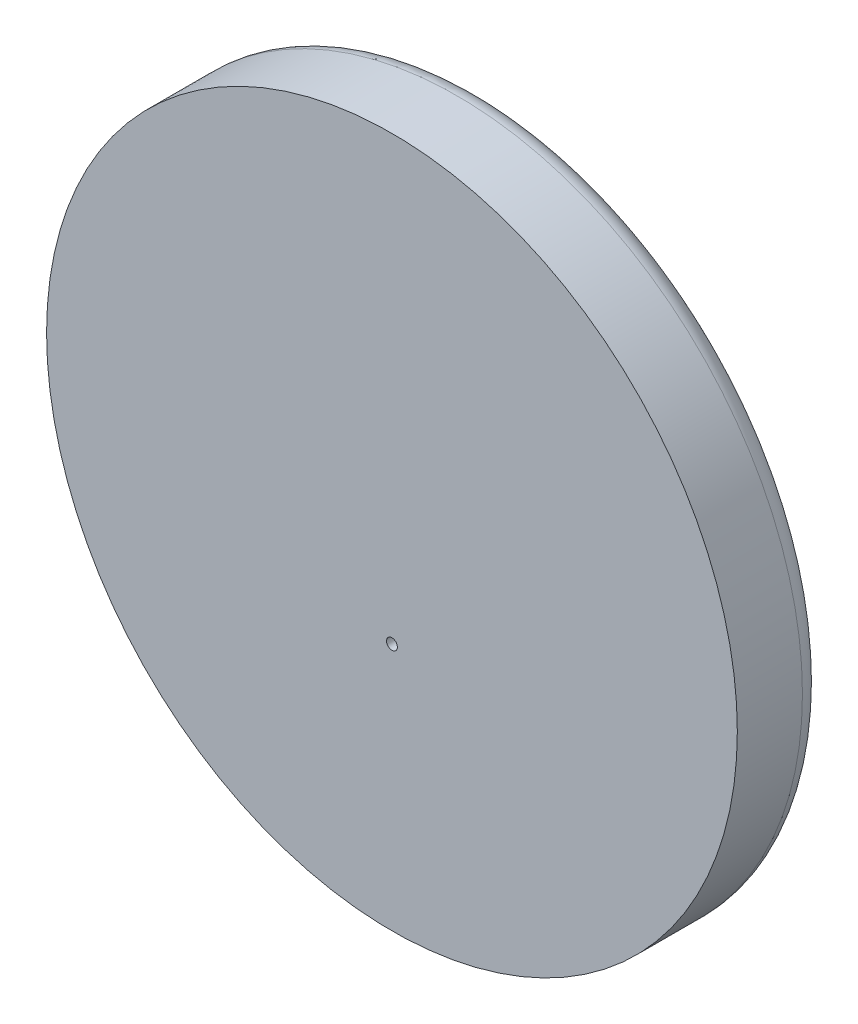
ISO-10303-21;
HEADER;
FILE_DESCRIPTION(('STEP AP214'),'2;1');
FILE_NAME('part.step','',(''),(''),'','','');
FILE_SCHEMA(('AUTOMOTIVE_DESIGN { 1 0 10303 214 1 1 1 1 }'));
ENDSEC;
DATA;
#1=APPLICATION_CONTEXT('core data for automotive mechanical design processes');
#2=APPLICATION_PROTOCOL_DEFINITION('international standard','automotive_design',2000,#1);
#3=PRODUCT_CONTEXT('',#1,'mechanical');
#4=PRODUCT('Part','Part','',(#3));
#5=PRODUCT_RELATED_PRODUCT_CATEGORY('part','',(#4));
#6=PRODUCT_DEFINITION_FORMATION('','',#4);
#7=PRODUCT_DEFINITION_CONTEXT('part definition',#1,'design');
#8=PRODUCT_DEFINITION('design','',#6,#7);
#9=PRODUCT_DEFINITION_SHAPE('','',#8);
#10=(LENGTH_UNIT() NAMED_UNIT(*) SI_UNIT(.MILLI.,.METRE.));
#11=(NAMED_UNIT(*) PLANE_ANGLE_UNIT() SI_UNIT($,.RADIAN.));
#12=(NAMED_UNIT(*) SI_UNIT($,.STERADIAN.) SOLID_ANGLE_UNIT());
#13=UNCERTAINTY_MEASURE_WITH_UNIT(LENGTH_MEASURE(1.E-05),#10,'distance_accuracy_value','');
#14=(GEOMETRIC_REPRESENTATION_CONTEXT(3) GLOBAL_UNCERTAINTY_ASSIGNED_CONTEXT((#13)) GLOBAL_UNIT_ASSIGNED_CONTEXT((#10,
#11,#12)) REPRESENTATION_CONTEXT('',''));
#15=CARTESIAN_POINT('',(0.,0.,0.));
#16=DIRECTION('',(0.,0.,1.));
#17=DIRECTION('',(1.,0.,0.));
#18=AXIS2_PLACEMENT_3D('',#15,#16,#17);
#19=CARTESIAN_POINT('',(0.,35.3882130465112,8.));
#20=DIRECTION('',(0.,0.,-1.));
#21=DIRECTION('',(-1.,0.,0.));
#22=AXIS2_PLACEMENT_3D('',#19,#20,#21);
#23=CYLINDRICAL_SURFACE('',#22,31.83);
#24=CARTESIAN_POINT('',(0.,35.3882130465112,2.));
#25=DIRECTION('',(0.,0.,1.));
#26=DIRECTION('',(1.,0.,0.));
#27=AXIS2_PLACEMENT_3D('',#24,#25,#26);
#28=CIRCLE('',#27,31.83);
#29=CARTESIAN_POINT('',(31.83,35.3882130465112,2.));
#30=VERTEX_POINT('',#29);
#31=EDGE_CURVE('E38',#30,#30,#28,.T.);
#32=ORIENTED_EDGE('',*,*,#31,.T.);
#33=EDGE_LOOP('',(#32));
#34=FACE_BOUND('',#33,.T.);
#35=CARTESIAN_POINT('',(0.,35.3882130465112,8.));
#36=DIRECTION('',(0.,0.,1.));
#37=DIRECTION('',(1.,0.,0.));
#38=AXIS2_PLACEMENT_3D('',#35,#36,#37);
#39=CIRCLE('',#38,31.83);
#40=CARTESIAN_POINT('',(31.83,35.3882130465112,8.));
#41=VERTEX_POINT('',#40);
#42=EDGE_CURVE('E42',#41,#41,#39,.T.);
#43=ORIENTED_EDGE('',*,*,#42,.F.);
#44=EDGE_LOOP('',(#43));
#45=FACE_BOUND('',#44,.T.);
#46=ADVANCED_FACE('F31',(#34,#45),#23,.T.);
#47=CARTESIAN_POINT('',(0.,35.3882130465112,8.));
#48=DIRECTION('',(0.,0.,1.));
#49=DIRECTION('',(1.,0.,0.));
#50=AXIS2_PLACEMENT_3D('',#47,#48,#49);
#51=PLANE('',#50);
#52=CARTESIAN_POINT('',(0.,26.4582130465112,8.));
#53=DIRECTION('',(0.,0.,1.));
#54=DIRECTION('',(1.,0.,0.));
#55=AXIS2_PLACEMENT_3D('',#52,#53,#54);
#56=CIRCLE('',#55,0.5);
#57=CARTESIAN_POINT('',(0.500000000000001,26.4582130465112,8.));
#58=VERTEX_POINT('',#57);
#59=EDGE_CURVE('E49',#58,#58,#56,.T.);
#60=ORIENTED_EDGE('',*,*,#59,.F.);
#61=EDGE_LOOP('',(#60));
#62=FACE_BOUND('',#61,.T.);
#63=ORIENTED_EDGE('',*,*,#42,.T.);
#64=EDGE_LOOP('',(#63));
#65=FACE_BOUND('',#64,.T.);
#66=ADVANCED_FACE('F63',(#62,#65),#51,.T.);
#67=CARTESIAN_POINT('',(0.,35.3882130465112,0.));
#68=DIRECTION('',(0.,0.,1.));
#69=DIRECTION('',(1.,0.,0.));
#70=AXIS2_PLACEMENT_3D('',#67,#68,#69);
#71=PLANE('',#70);
#72=CARTESIAN_POINT('',(0.,26.4582130465112,0.));
#73=DIRECTION('',(0.,0.,1.));
#74=DIRECTION('',(1.,0.,0.));
#75=AXIS2_PLACEMENT_3D('',#72,#73,#74);
#76=CIRCLE('',#75,0.5);
#77=CARTESIAN_POINT('',(0.500000000000001,26.4582130465112,0.));
#78=VERTEX_POINT('',#77);
#79=EDGE_CURVE('E46',#78,#78,#76,.T.);
#80=ORIENTED_EDGE('',*,*,#79,.T.);
#81=EDGE_LOOP('',(#80));
#82=FACE_BOUND('',#81,.T.);
#83=CARTESIAN_POINT('',(0.,35.3882130465112,0.));
#84=DIRECTION('',(0.,0.,1.));
#85=DIRECTION('',(1.,0.,0.));
#86=AXIS2_PLACEMENT_3D('',#83,#84,#85);
#87=CIRCLE('',#86,29.83);
#88=CARTESIAN_POINT('',(29.83,35.3882130465112,0.));
#89=VERTEX_POINT('',#88);
#90=EDGE_CURVE('E10',#89,#89,#87,.F.);
#91=ORIENTED_EDGE('',*,*,#90,.T.);
#92=EDGE_LOOP('',(#91));
#93=FACE_BOUND('',#92,.T.);
#94=ADVANCED_FACE('F55',(#82,#93),#71,.F.);
#95=CARTESIAN_POINT('',(0.,35.3882130465112,2.));
#96=DIRECTION('',(0.,0.,1.));
#97=DIRECTION('',(1.,0.,0.));
#98=AXIS2_PLACEMENT_3D('',#95,#96,#97);
#99=TOROIDAL_SURFACE('',#98,29.83,2.);
#100=ORIENTED_EDGE('',*,*,#90,.F.);
#101=EDGE_LOOP('',(#100));
#102=FACE_BOUND('',#101,.T.);
#103=ORIENTED_EDGE('',*,*,#31,.F.);
#104=EDGE_LOOP('',(#103));
#105=FACE_BOUND('',#104,.T.);
#106=ADVANCED_FACE('F33',(#102,#105),#99,.T.);
#107=CARTESIAN_POINT('',(0.,26.4582130465112,0.));
#108=DIRECTION('',(0.,0.,1.));
#109=DIRECTION('',(1.,0.,0.));
#110=AXIS2_PLACEMENT_3D('',#107,#108,#109);
#111=CYLINDRICAL_SURFACE('',#110,0.5);
#112=ORIENTED_EDGE('',*,*,#79,.F.);
#113=EDGE_LOOP('',(#112));
#114=FACE_BOUND('',#113,.T.);
#115=ORIENTED_EDGE('',*,*,#59,.T.);
#116=EDGE_LOOP('',(#115));
#117=FACE_BOUND('',#116,.T.);
#118=ADVANCED_FACE('F57',(#114,#117),#111,.F.);
#119=CLOSED_SHELL('',(#46,#66,#94,#106,#118));
#120=MANIFOLD_SOLID_BREP('B2',#119);
#121=ADVANCED_BREP_SHAPE_REPRESENTATION('',(#18,#120),#14);
#122=SHAPE_DEFINITION_REPRESENTATION(#9,#121);
ENDSEC;
END-ISO-10303-21;
